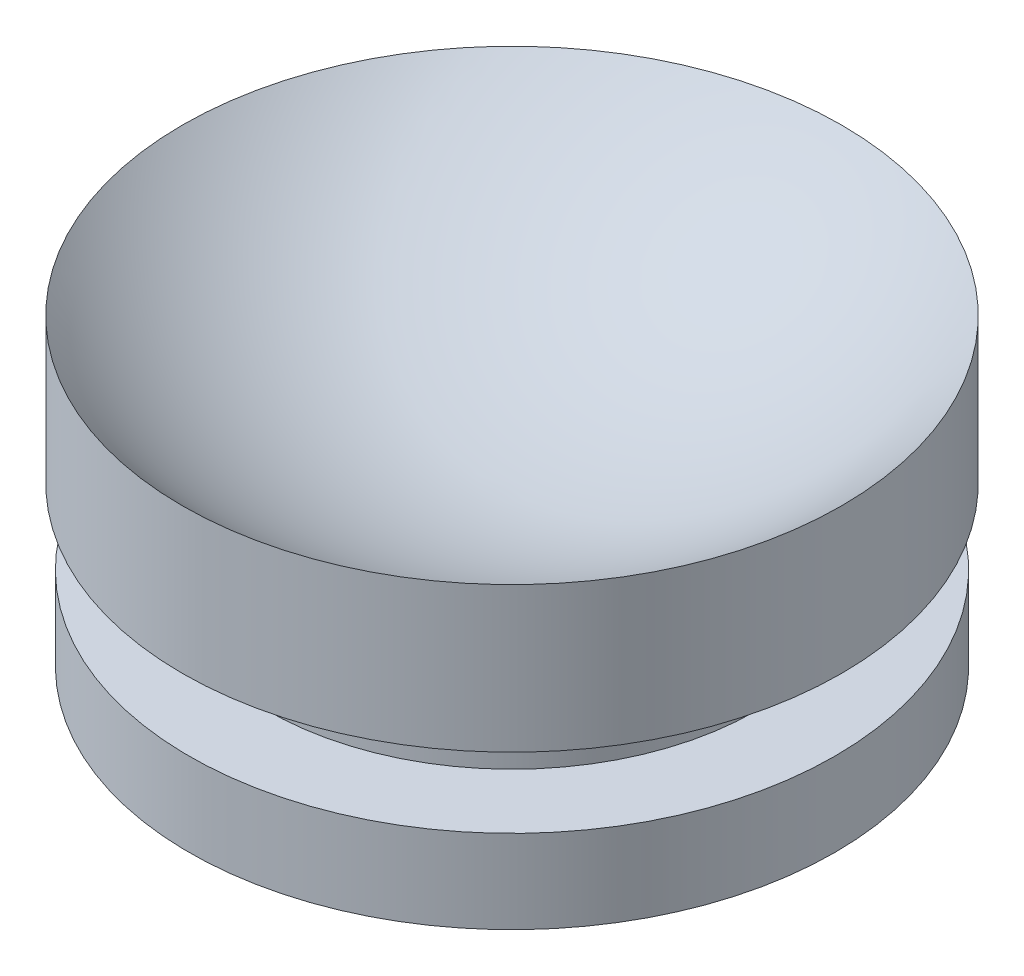
ISO-10303-21;
HEADER;
FILE_DESCRIPTION(('STEP AP214'),'2;1');
FILE_NAME('part.step','',(''),(''),'','','');
FILE_SCHEMA(('AUTOMOTIVE_DESIGN { 1 0 10303 214 1 1 1 1 }'));
ENDSEC;
DATA;
#1=APPLICATION_CONTEXT('core data for automotive mechanical design processes');
#2=APPLICATION_PROTOCOL_DEFINITION('international standard','automotive_design',2000,#1);
#3=PRODUCT_CONTEXT('',#1,'mechanical');
#4=PRODUCT('Part','Part','',(#3));
#5=PRODUCT_RELATED_PRODUCT_CATEGORY('part','',(#4));
#6=PRODUCT_DEFINITION_FORMATION('','',#4);
#7=PRODUCT_DEFINITION_CONTEXT('part definition',#1,'design');
#8=PRODUCT_DEFINITION('design','',#6,#7);
#9=PRODUCT_DEFINITION_SHAPE('','',#8);
#10=(LENGTH_UNIT() NAMED_UNIT(*) SI_UNIT(.MILLI.,.METRE.));
#11=(NAMED_UNIT(*) PLANE_ANGLE_UNIT() SI_UNIT($,.RADIAN.));
#12=(NAMED_UNIT(*) SI_UNIT($,.STERADIAN.) SOLID_ANGLE_UNIT());
#13=UNCERTAINTY_MEASURE_WITH_UNIT(LENGTH_MEASURE(1.E-05),#10,'distance_accuracy_value','');
#14=(GEOMETRIC_REPRESENTATION_CONTEXT(3) GLOBAL_UNCERTAINTY_ASSIGNED_CONTEXT((#13)) GLOBAL_UNIT_ASSIGNED_CONTEXT((#10,
#11,#12)) REPRESENTATION_CONTEXT('',''));
#15=CARTESIAN_POINT('',(0.,0.,0.));
#16=DIRECTION('',(0.,0.,1.));
#17=DIRECTION('',(1.,0.,0.));
#18=AXIS2_PLACEMENT_3D('',#15,#16,#17);
#19=CARTESIAN_POINT('',(0.,18.4364042872436,0.));
#20=DIRECTION('',(0.,-1.,0.));
#21=DIRECTION('',(1.,0.,0.));
#22=AXIS2_PLACEMENT_3D('',#19,#20,#21);
#23=SPHERICAL_SURFACE('',#22,13.6104042872436);
#24=CARTESIAN_POINT('',(0.,9.2456,0.));
#25=DIRECTION('',(0.,-1.,0.));
#26=DIRECTION('',(1.,0.,0.));
#27=AXIS2_PLACEMENT_3D('',#24,#25,#26);
#28=CIRCLE('',#27,10.038536816479);
#29=CARTESIAN_POINT('',(10.038536816479,9.2456,0.));
#30=VERTEX_POINT('',#29);
#31=EDGE_CURVE('E45',#30,#30,#28,.T.);
#32=ORIENTED_EDGE('',*,*,#31,.F.);
#33=EDGE_LOOP('',(#32));
#34=FACE_BOUND('',#33,.T.);
#35=ADVANCED_FACE('F34',(#34),#23,.F.);
#36=CARTESIAN_POINT('',(0.,0.,0.));
#37=DIRECTION('',(0.,-1.,0.));
#38=DIRECTION('',(1.,0.,0.));
#39=AXIS2_PLACEMENT_3D('',#36,#37,#38);
#40=CYLINDRICAL_SURFACE('',#39,10.038536816479);
#41=ORIENTED_EDGE('',*,*,#31,.T.);
#42=EDGE_LOOP('',(#41));
#43=FACE_BOUND('',#42,.T.);
#44=CARTESIAN_POINT('',(0.,4.826,0.));
#45=DIRECTION('',(0.,-1.,0.));
#46=DIRECTION('',(1.,0.,0.));
#47=AXIS2_PLACEMENT_3D('',#44,#45,#46);
#48=CIRCLE('',#47,10.038536816479);
#49=CARTESIAN_POINT('',(10.038536816479,4.826,0.));
#50=VERTEX_POINT('',#49);
#51=EDGE_CURVE('E41',#50,#50,#48,.T.);
#52=ORIENTED_EDGE('',*,*,#51,.F.);
#53=EDGE_LOOP('',(#52));
#54=FACE_BOUND('',#53,.T.);
#55=ADVANCED_FACE('F73',(#43,#54),#40,.T.);
#56=CARTESIAN_POINT('',(0.,4.826,0.));
#57=DIRECTION('',(0.,1.,0.));
#58=DIRECTION('',(-1.,0.,0.));
#59=AXIS2_PLACEMENT_3D('',#56,#57,#58);
#60=PLANE('',#59);
#61=CARTESIAN_POINT('',(0.,4.826,0.));
#62=DIRECTION('',(0.,-1.,0.));
#63=DIRECTION('',(1.,0.,0.));
#64=AXIS2_PLACEMENT_3D('',#61,#62,#63);
#65=CIRCLE('',#64,7.44042331606218);
#66=CARTESIAN_POINT('',(7.44042331606218,4.826,0.));
#67=VERTEX_POINT('',#66);
#68=EDGE_CURVE('E10',#67,#67,#65,.T.);
#69=ORIENTED_EDGE('',*,*,#68,.F.);
#70=EDGE_LOOP('',(#69));
#71=FACE_BOUND('',#70,.T.);
#72=ORIENTED_EDGE('',*,*,#51,.T.);
#73=EDGE_LOOP('',(#72));
#74=FACE_BOUND('',#73,.T.);
#75=ADVANCED_FACE('F77',(#71,#74),#60,.F.);
#76=CARTESIAN_POINT('',(0.,2.54,0.));
#77=DIRECTION('',(0.,1.,0.));
#78=DIRECTION('',(-1.,0.,0.));
#79=AXIS2_PLACEMENT_3D('',#76,#77,#78);
#80=PLANE('',#79);
#81=CARTESIAN_POINT('',(0.,2.54,0.));
#82=DIRECTION('',(0.,-1.,0.));
#83=DIRECTION('',(1.,0.,0.));
#84=AXIS2_PLACEMENT_3D('',#81,#82,#83);
#85=CIRCLE('',#84,7.44042331606218);
#86=CARTESIAN_POINT('',(7.44042331606218,2.54,0.));
#87=VERTEX_POINT('',#86);
#88=EDGE_CURVE('E57',#87,#87,#85,.T.);
#89=ORIENTED_EDGE('',*,*,#88,.T.);
#90=EDGE_LOOP('',(#89));
#91=FACE_BOUND('',#90,.T.);
#92=CARTESIAN_POINT('',(0.,2.54,0.));
#93=DIRECTION('',(0.,-1.,0.));
#94=DIRECTION('',(1.,0.,0.));
#95=AXIS2_PLACEMENT_3D('',#92,#93,#94);
#96=CIRCLE('',#95,9.83151088082901);
#97=CARTESIAN_POINT('',(9.83151088082901,2.54,0.));
#98=VERTEX_POINT('',#97);
#99=EDGE_CURVE('E54',#98,#98,#96,.T.);
#100=ORIENTED_EDGE('',*,*,#99,.F.);
#101=EDGE_LOOP('',(#100));
#102=FACE_BOUND('',#101,.T.);
#103=ADVANCED_FACE('F61',(#91,#102),#80,.T.);
#104=CARTESIAN_POINT('',(0.,0.,0.));
#105=DIRECTION('',(0.,-1.,0.));
#106=DIRECTION('',(1.,0.,0.));
#107=AXIS2_PLACEMENT_3D('',#104,#105,#106);
#108=CYLINDRICAL_SURFACE('',#107,9.83151088082901);
#109=ORIENTED_EDGE('',*,*,#99,.T.);
#110=EDGE_LOOP('',(#109));
#111=FACE_BOUND('',#110,.T.);
#112=CARTESIAN_POINT('',(0.,0.,0.));
#113=DIRECTION('',(0.,-1.,0.));
#114=DIRECTION('',(1.,0.,0.));
#115=AXIS2_PLACEMENT_3D('',#112,#113,#114);
#116=CIRCLE('',#115,9.83151088082901);
#117=CARTESIAN_POINT('',(9.83151088082901,0.,0.));
#118=VERTEX_POINT('',#117);
#119=EDGE_CURVE('E49',#118,#118,#116,.T.);
#120=ORIENTED_EDGE('',*,*,#119,.F.);
#121=EDGE_LOOP('',(#120));
#122=FACE_BOUND('',#121,.T.);
#123=ADVANCED_FACE('F66',(#111,#122),#108,.T.);
#124=CARTESIAN_POINT('',(0.,0.,0.));
#125=DIRECTION('',(0.,-1.,0.));
#126=DIRECTION('',(1.,0.,0.));
#127=AXIS2_PLACEMENT_3D('',#124,#125,#126);
#128=CYLINDRICAL_SURFACE('',#127,7.44042331606218);
#129=ORIENTED_EDGE('',*,*,#68,.T.);
#130=EDGE_LOOP('',(#129));
#131=FACE_BOUND('',#130,.T.);
#132=ORIENTED_EDGE('',*,*,#88,.F.);
#133=EDGE_LOOP('',(#132));
#134=FACE_BOUND('',#133,.T.);
#135=ADVANCED_FACE('F36',(#131,#134),#128,.T.);
#136=CARTESIAN_POINT('',(0.,0.,0.));
#137=DIRECTION('',(0.,-1.,0.));
#138=DIRECTION('',(1.,0.,0.));
#139=AXIS2_PLACEMENT_3D('',#136,#137,#138);
#140=PLANE('',#139);
#141=ORIENTED_EDGE('',*,*,#119,.T.);
#142=EDGE_LOOP('',(#141));
#143=FACE_BOUND('',#142,.T.);
#144=ADVANCED_FACE('F65',(#143),#140,.T.);
#145=CLOSED_SHELL('',(#35,#55,#75,#103,#123,#135,#144));
#146=MANIFOLD_SOLID_BREP('B2',#145);
#147=ADVANCED_BREP_SHAPE_REPRESENTATION('',(#18,#146),#14);
#148=SHAPE_DEFINITION_REPRESENTATION(#9,#147);
ENDSEC;
END-ISO-10303-21;
